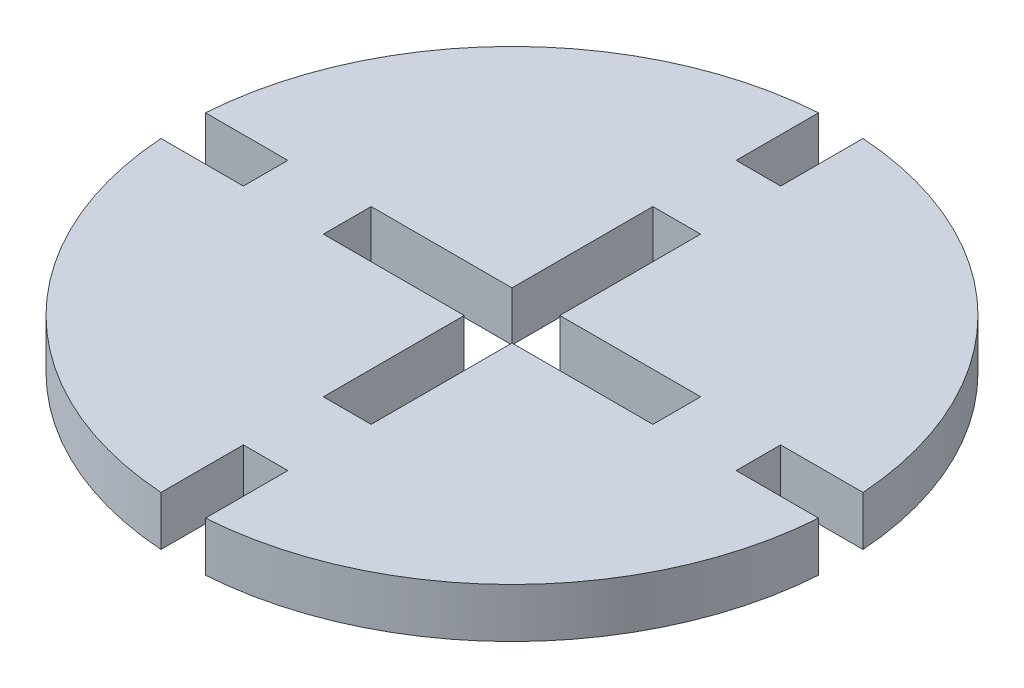
ISO-10303-21;
HEADER;
FILE_DESCRIPTION(('STEP AP214'),'2;1');
FILE_NAME('part.step','',(''),(''),'','','');
FILE_SCHEMA(('AUTOMOTIVE_DESIGN { 1 0 10303 214 1 1 1 1 }'));
ENDSEC;
DATA;
#1=APPLICATION_CONTEXT('core data for automotive mechanical design processes');
#2=APPLICATION_PROTOCOL_DEFINITION('international standard','automotive_design',2000,#1);
#3=PRODUCT_CONTEXT('',#1,'mechanical');
#4=PRODUCT('Part','Part','',(#3));
#5=PRODUCT_RELATED_PRODUCT_CATEGORY('part','',(#4));
#6=PRODUCT_DEFINITION_FORMATION('','',#4);
#7=PRODUCT_DEFINITION_CONTEXT('part definition',#1,'design');
#8=PRODUCT_DEFINITION('design','',#6,#7);
#9=PRODUCT_DEFINITION_SHAPE('','',#8);
#10=(LENGTH_UNIT() NAMED_UNIT(*) SI_UNIT(.MILLI.,.METRE.));
#11=(NAMED_UNIT(*) PLANE_ANGLE_UNIT() SI_UNIT($,.RADIAN.));
#12=(NAMED_UNIT(*) SI_UNIT($,.STERADIAN.) SOLID_ANGLE_UNIT());
#13=UNCERTAINTY_MEASURE_WITH_UNIT(LENGTH_MEASURE(1.E-05),#10,'distance_accuracy_value','');
#14=(GEOMETRIC_REPRESENTATION_CONTEXT(3) GLOBAL_UNCERTAINTY_ASSIGNED_CONTEXT((#13)) GLOBAL_UNIT_ASSIGNED_CONTEXT((#10,
#11,#12)) REPRESENTATION_CONTEXT('',''));
#15=CARTESIAN_POINT('',(0.,0.,0.));
#16=DIRECTION('',(0.,0.,1.));
#17=DIRECTION('',(1.,0.,0.));
#18=AXIS2_PLACEMENT_3D('',#15,#16,#17);
#19=CARTESIAN_POINT('',(-19.9543854828957,3.,1.35));
#20=DIRECTION('',(0.,0.,1.));
#21=DIRECTION('',(1.,0.,0.));
#22=AXIS2_PLACEMENT_3D('',#19,#20,#21);
#23=PLANE('',#22);
#24=DIRECTION('',(-1.,0.,0.));
#25=VECTOR('',#24,1.);
#26=CARTESIAN_POINT('',(-19.9543854828957,0.,1.35));
#27=LINE('',#26,#25);
#28=CARTESIAN_POINT('',(-14.9543854828957,0.,1.35));
#29=VERTEX_POINT('',#28);
#30=CARTESIAN_POINT('',(-19.9543854828957,0.,1.35));
#31=VERTEX_POINT('',#30);
#32=EDGE_CURVE('E231',#29,#31,#27,.T.);
#33=ORIENTED_EDGE('',*,*,#32,.T.);
#34=DIRECTION('',(0.,-1.,0.));
#35=VECTOR('',#34,1.);
#36=CARTESIAN_POINT('',(-19.9543854828957,3.,1.35));
#37=LINE('',#36,#35);
#38=CARTESIAN_POINT('',(-19.9543854828957,3.,1.35));
#39=VERTEX_POINT('',#38);
#40=EDGE_CURVE('E11',#39,#31,#37,.T.);
#41=ORIENTED_EDGE('',*,*,#40,.F.);
#42=DIRECTION('',(-1.,0.,0.));
#43=VECTOR('',#42,1.);
#44=CARTESIAN_POINT('',(-19.9543854828957,3.,1.35));
#45=LINE('',#44,#43);
#46=CARTESIAN_POINT('',(-14.9543854828957,3.,1.35));
#47=VERTEX_POINT('',#46);
#48=EDGE_CURVE('E296',#47,#39,#45,.T.);
#49=ORIENTED_EDGE('',*,*,#48,.F.);
#50=DIRECTION('',(0.,-1.,0.));
#51=VECTOR('',#50,1.);
#52=CARTESIAN_POINT('',(-14.9543854828957,3.,1.35));
#53=LINE('',#52,#51);
#54=EDGE_CURVE('E330',#47,#29,#53,.T.);
#55=ORIENTED_EDGE('',*,*,#54,.T.);
#56=EDGE_LOOP('',(#33,#41,#49,#55));
#57=FACE_BOUND('',#56,.T.);
#58=ADVANCED_FACE('F33',(#57),#23,.F.);
#59=CARTESIAN_POINT('',(0.,3.,0.));
#60=DIRECTION('',(0.,-1.,0.));
#61=DIRECTION('',(0.,0.,-1.));
#62=AXIS2_PLACEMENT_3D('',#59,#60,#61);
#63=CYLINDRICAL_SURFACE('',#62,20.);
#64=CARTESIAN_POINT('',(0.,0.,0.));
#65=DIRECTION('',(0.,1.,0.));
#66=DIRECTION('',(0.,0.,-1.));
#67=AXIS2_PLACEMENT_3D('',#64,#65,#66);
#68=CIRCLE('',#67,20.);
#69=CARTESIAN_POINT('',(-1.35,0.,19.9543854828957));
#70=VERTEX_POINT('',#69);
#71=EDGE_CURVE('E333',#31,#70,#68,.T.);
#72=ORIENTED_EDGE('',*,*,#71,.T.);
#73=DIRECTION('',(0.,-1.,0.));
#74=VECTOR('',#73,1.);
#75=CARTESIAN_POINT('',(-1.35,3.,19.9543854828957));
#76=LINE('',#75,#74);
#77=CARTESIAN_POINT('',(-1.35,3.,19.9543854828957));
#78=VERTEX_POINT('',#77);
#79=EDGE_CURVE('E40',#78,#70,#76,.T.);
#80=ORIENTED_EDGE('',*,*,#79,.F.);
#81=CARTESIAN_POINT('',(0.,3.,0.));
#82=DIRECTION('',(0.,1.,0.));
#83=DIRECTION('',(0.,0.,-1.));
#84=AXIS2_PLACEMENT_3D('',#81,#82,#83);
#85=CIRCLE('',#84,20.);
#86=EDGE_CURVE('E299',#39,#78,#85,.T.);
#87=ORIENTED_EDGE('',*,*,#86,.F.);
#88=ORIENTED_EDGE('',*,*,#40,.T.);
#89=EDGE_LOOP('',(#72,#80,#87,#88));
#90=FACE_BOUND('',#89,.T.);
#91=ADVANCED_FACE('F428',(#90),#63,.T.);
#92=CARTESIAN_POINT('',(-1.35,3.,14.9543854828957));
#93=DIRECTION('',(-1.,0.,0.));
#94=DIRECTION('',(0.,0.,1.));
#95=AXIS2_PLACEMENT_3D('',#92,#93,#94);
#96=PLANE('',#95);
#97=DIRECTION('',(0.,0.,-1.));
#98=VECTOR('',#97,1.);
#99=CARTESIAN_POINT('',(-1.35,0.,14.9543854828957));
#100=LINE('',#99,#98);
#101=CARTESIAN_POINT('',(-1.35,0.,14.9543854828957));
#102=VERTEX_POINT('',#101);
#103=EDGE_CURVE('E335',#70,#102,#100,.T.);
#104=ORIENTED_EDGE('',*,*,#103,.T.);
#105=DIRECTION('',(0.,-1.,0.));
#106=VECTOR('',#105,1.);
#107=CARTESIAN_POINT('',(-1.35,3.,14.9543854828957));
#108=LINE('',#107,#106);
#109=CARTESIAN_POINT('',(-1.35,3.,14.9543854828957));
#110=VERTEX_POINT('',#109);
#111=EDGE_CURVE('E400',#110,#102,#108,.T.);
#112=ORIENTED_EDGE('',*,*,#111,.F.);
#113=DIRECTION('',(0.,0.,-1.));
#114=VECTOR('',#113,1.);
#115=CARTESIAN_POINT('',(-1.35,3.,14.9543854828957));
#116=LINE('',#115,#114);
#117=EDGE_CURVE('E302',#78,#110,#116,.T.);
#118=ORIENTED_EDGE('',*,*,#117,.F.);
#119=ORIENTED_EDGE('',*,*,#79,.T.);
#120=EDGE_LOOP('',(#104,#112,#118,#119));
#121=FACE_BOUND('',#120,.T.);
#122=ADVANCED_FACE('F407',(#121),#96,.F.);
#123=CARTESIAN_POINT('',(1.35000000000001,3.,14.9543854828957));
#124=DIRECTION('',(0.,0.,-1.));
#125=DIRECTION('',(-1.,0.,0.));
#126=AXIS2_PLACEMENT_3D('',#123,#124,#125);
#127=PLANE('',#126);
#128=DIRECTION('',(1.,0.,0.));
#129=VECTOR('',#128,1.);
#130=CARTESIAN_POINT('',(1.35000000000001,0.,14.9543854828957));
#131=LINE('',#130,#129);
#132=CARTESIAN_POINT('',(1.35000000000001,0.,14.9543854828957));
#133=VERTEX_POINT('',#132);
#134=EDGE_CURVE('E337',#102,#133,#131,.T.);
#135=ORIENTED_EDGE('',*,*,#134,.T.);
#136=DIRECTION('',(0.,-1.,0.));
#137=VECTOR('',#136,1.);
#138=CARTESIAN_POINT('',(1.35000000000001,3.,14.9543854828957));
#139=LINE('',#138,#137);
#140=CARTESIAN_POINT('',(1.35000000000001,3.,14.9543854828957));
#141=VERTEX_POINT('',#140);
#142=EDGE_CURVE('E397',#141,#133,#139,.T.);
#143=ORIENTED_EDGE('',*,*,#142,.F.);
#144=DIRECTION('',(1.,0.,0.));
#145=VECTOR('',#144,1.);
#146=CARTESIAN_POINT('',(1.35000000000001,3.,14.9543854828957));
#147=LINE('',#146,#145);
#148=EDGE_CURVE('E304',#110,#141,#147,.T.);
#149=ORIENTED_EDGE('',*,*,#148,.F.);
#150=ORIENTED_EDGE('',*,*,#111,.T.);
#151=EDGE_LOOP('',(#135,#143,#149,#150));
#152=FACE_BOUND('',#151,.T.);
#153=ADVANCED_FACE('F416',(#152),#127,.F.);
#154=CARTESIAN_POINT('',(1.35000000000001,3.,14.9543854828957));
#155=DIRECTION('',(1.,0.,0.));
#156=DIRECTION('',(0.,0.,-1.));
#157=AXIS2_PLACEMENT_3D('',#154,#155,#156);
#158=PLANE('',#157);
#159=DIRECTION('',(0.,0.,1.));
#160=VECTOR('',#159,1.);
#161=CARTESIAN_POINT('',(1.35000000000001,0.,14.9543854828957));
#162=LINE('',#161,#160);
#163=CARTESIAN_POINT('',(1.35000000000001,0.,19.9543854828957));
#164=VERTEX_POINT('',#163);
#165=EDGE_CURVE('E339',#133,#164,#162,.T.);
#166=ORIENTED_EDGE('',*,*,#165,.T.);
#167=DIRECTION('',(0.,-1.,0.));
#168=VECTOR('',#167,1.);
#169=CARTESIAN_POINT('',(1.35000000000001,3.,19.9543854828957));
#170=LINE('',#169,#168);
#171=CARTESIAN_POINT('',(1.35000000000001,3.,19.9543854828957));
#172=VERTEX_POINT('',#171);
#173=EDGE_CURVE('E394',#172,#164,#170,.T.);
#174=ORIENTED_EDGE('',*,*,#173,.F.);
#175=DIRECTION('',(0.,0.,1.));
#176=VECTOR('',#175,1.);
#177=CARTESIAN_POINT('',(1.35000000000001,3.,14.9543854828957));
#178=LINE('',#177,#176);
#179=EDGE_CURVE('E306',#141,#172,#178,.T.);
#180=ORIENTED_EDGE('',*,*,#179,.F.);
#181=ORIENTED_EDGE('',*,*,#142,.T.);
#182=EDGE_LOOP('',(#166,#174,#180,#181));
#183=FACE_BOUND('',#182,.T.);
#184=ADVANCED_FACE('F420',(#183),#158,.F.);
#185=CARTESIAN_POINT('',(0.,3.,0.));
#186=DIRECTION('',(0.,-1.,0.));
#187=DIRECTION('',(0.,0.,-1.));
#188=AXIS2_PLACEMENT_3D('',#185,#186,#187);
#189=CYLINDRICAL_SURFACE('',#188,20.);
#190=CARTESIAN_POINT('',(0.,0.,0.));
#191=DIRECTION('',(0.,1.,0.));
#192=DIRECTION('',(0.,0.,1.));
#193=AXIS2_PLACEMENT_3D('',#190,#191,#192);
#194=CIRCLE('',#193,20.);
#195=CARTESIAN_POINT('',(19.9543854828957,0.,1.34999999999999));
#196=VERTEX_POINT('',#195);
#197=EDGE_CURVE('E341',#164,#196,#194,.T.);
#198=ORIENTED_EDGE('',*,*,#197,.T.);
#199=DIRECTION('',(0.,-1.,0.));
#200=VECTOR('',#199,1.);
#201=CARTESIAN_POINT('',(19.9543854828957,3.,1.34999999999999));
#202=LINE('',#201,#200);
#203=CARTESIAN_POINT('',(19.9543854828957,3.,1.34999999999999));
#204=VERTEX_POINT('',#203);
#205=EDGE_CURVE('E391',#204,#196,#202,.T.);
#206=ORIENTED_EDGE('',*,*,#205,.F.);
#207=CARTESIAN_POINT('',(0.,3.,0.));
#208=DIRECTION('',(0.,1.,0.));
#209=DIRECTION('',(0.,0.,1.));
#210=AXIS2_PLACEMENT_3D('',#207,#208,#209);
#211=CIRCLE('',#210,20.);
#212=EDGE_CURVE('E308',#172,#204,#211,.T.);
#213=ORIENTED_EDGE('',*,*,#212,.F.);
#214=ORIENTED_EDGE('',*,*,#173,.T.);
#215=EDGE_LOOP('',(#198,#206,#213,#214));
#216=FACE_BOUND('',#215,.T.);
#217=ADVANCED_FACE('F481',(#216),#189,.T.);
#218=CARTESIAN_POINT('',(19.9543854828957,3.,1.34999999999999));
#219=DIRECTION('',(0.,0.,1.));
#220=DIRECTION('',(1.,0.,0.));
#221=AXIS2_PLACEMENT_3D('',#218,#219,#220);
#222=PLANE('',#221);
#223=DIRECTION('',(-1.,0.,0.));
#224=VECTOR('',#223,1.);
#225=CARTESIAN_POINT('',(19.9543854828957,0.,1.34999999999999));
#226=LINE('',#225,#224);
#227=CARTESIAN_POINT('',(14.9543854828957,0.,1.35));
#228=VERTEX_POINT('',#227);
#229=EDGE_CURVE('E343',#196,#228,#226,.T.);
#230=ORIENTED_EDGE('',*,*,#229,.T.);
#231=DIRECTION('',(0.,-1.,0.));
#232=VECTOR('',#231,1.);
#233=CARTESIAN_POINT('',(14.9543854828957,3.,1.35));
#234=LINE('',#233,#232);
#235=CARTESIAN_POINT('',(14.9543854828957,3.,1.35));
#236=VERTEX_POINT('',#235);
#237=EDGE_CURVE('E388',#236,#228,#234,.T.);
#238=ORIENTED_EDGE('',*,*,#237,.F.);
#239=DIRECTION('',(-1.,0.,0.));
#240=VECTOR('',#239,1.);
#241=CARTESIAN_POINT('',(19.9543854828957,3.,1.34999999999999));
#242=LINE('',#241,#240);
#243=EDGE_CURVE('E310',#204,#236,#242,.T.);
#244=ORIENTED_EDGE('',*,*,#243,.F.);
#245=ORIENTED_EDGE('',*,*,#205,.T.);
#246=EDGE_LOOP('',(#230,#238,#244,#245));
#247=FACE_BOUND('',#246,.T.);
#248=ADVANCED_FACE('F478',(#247),#222,.F.);
#249=CARTESIAN_POINT('',(14.9543854828957,3.,-1.35));
#250=DIRECTION('',(-1.,0.,0.));
#251=DIRECTION('',(0.,0.,1.));
#252=AXIS2_PLACEMENT_3D('',#249,#250,#251);
#253=PLANE('',#252);
#254=DIRECTION('',(0.,0.,-1.));
#255=VECTOR('',#254,1.);
#256=CARTESIAN_POINT('',(14.9543854828957,0.,-1.35));
#257=LINE('',#256,#255);
#258=CARTESIAN_POINT('',(14.9543854828957,0.,-1.35));
#259=VERTEX_POINT('',#258);
#260=EDGE_CURVE('E345',#228,#259,#257,.T.);
#261=ORIENTED_EDGE('',*,*,#260,.T.);
#262=DIRECTION('',(0.,-1.,0.));
#263=VECTOR('',#262,1.);
#264=CARTESIAN_POINT('',(14.9543854828957,3.,-1.35));
#265=LINE('',#264,#263);
#266=CARTESIAN_POINT('',(14.9543854828957,3.,-1.35));
#267=VERTEX_POINT('',#266);
#268=EDGE_CURVE('E385',#267,#259,#265,.T.);
#269=ORIENTED_EDGE('',*,*,#268,.F.);
#270=DIRECTION('',(0.,0.,-1.));
#271=VECTOR('',#270,1.);
#272=CARTESIAN_POINT('',(14.9543854828957,3.,-1.35));
#273=LINE('',#272,#271);
#274=EDGE_CURVE('E312',#236,#267,#273,.T.);
#275=ORIENTED_EDGE('',*,*,#274,.F.);
#276=ORIENTED_EDGE('',*,*,#237,.T.);
#277=EDGE_LOOP('',(#261,#269,#275,#276));
#278=FACE_BOUND('',#277,.T.);
#279=ADVANCED_FACE('F474',(#278),#253,.F.);
#280=CARTESIAN_POINT('',(19.9543854828957,3.,-1.34999999999999));
#281=DIRECTION('',(0.,0.,-1.));
#282=DIRECTION('',(-1.,0.,0.));
#283=AXIS2_PLACEMENT_3D('',#280,#281,#282);
#284=PLANE('',#283);
#285=DIRECTION('',(1.,0.,0.));
#286=VECTOR('',#285,1.);
#287=CARTESIAN_POINT('',(19.9543854828957,0.,-1.34999999999999));
#288=LINE('',#287,#286);
#289=CARTESIAN_POINT('',(19.9543854828957,0.,-1.34999999999999));
#290=VERTEX_POINT('',#289);
#291=EDGE_CURVE('E347',#259,#290,#288,.T.);
#292=ORIENTED_EDGE('',*,*,#291,.T.);
#293=DIRECTION('',(0.,-1.,0.));
#294=VECTOR('',#293,1.);
#295=CARTESIAN_POINT('',(19.9543854828957,3.,-1.34999999999999));
#296=LINE('',#295,#294);
#297=CARTESIAN_POINT('',(19.9543854828957,3.,-1.34999999999999));
#298=VERTEX_POINT('',#297);
#299=EDGE_CURVE('E382',#298,#290,#296,.T.);
#300=ORIENTED_EDGE('',*,*,#299,.F.);
#301=DIRECTION('',(1.,0.,0.));
#302=VECTOR('',#301,1.);
#303=CARTESIAN_POINT('',(19.9543854828957,3.,-1.34999999999999));
#304=LINE('',#303,#302);
#305=EDGE_CURVE('E314',#267,#298,#304,.T.);
#306=ORIENTED_EDGE('',*,*,#305,.F.);
#307=ORIENTED_EDGE('',*,*,#268,.T.);
#308=EDGE_LOOP('',(#292,#300,#306,#307));
#309=FACE_BOUND('',#308,.T.);
#310=ADVANCED_FACE('F470',(#309),#284,.F.);
#311=CARTESIAN_POINT('',(0.,3.,0.));
#312=DIRECTION('',(0.,-1.,0.));
#313=DIRECTION('',(0.,0.,-1.));
#314=AXIS2_PLACEMENT_3D('',#311,#312,#313);
#315=CYLINDRICAL_SURFACE('',#314,20.);
#316=CARTESIAN_POINT('',(0.,0.,0.));
#317=DIRECTION('',(0.,1.,0.));
#318=DIRECTION('',(0.,0.,-1.));
#319=AXIS2_PLACEMENT_3D('',#316,#317,#318);
#320=CIRCLE('',#319,20.);
#321=CARTESIAN_POINT('',(1.35000000000001,0.,-19.9543854828957));
#322=VERTEX_POINT('',#321);
#323=EDGE_CURVE('E349',#290,#322,#320,.T.);
#324=ORIENTED_EDGE('',*,*,#323,.T.);
#325=DIRECTION('',(0.,-1.,0.));
#326=VECTOR('',#325,1.);
#327=CARTESIAN_POINT('',(1.35000000000001,3.,-19.9543854828957));
#328=LINE('',#327,#326);
#329=CARTESIAN_POINT('',(1.35000000000001,3.,-19.9543854828957));
#330=VERTEX_POINT('',#329);
#331=EDGE_CURVE('E379',#330,#322,#328,.T.);
#332=ORIENTED_EDGE('',*,*,#331,.F.);
#333=CARTESIAN_POINT('',(0.,3.,0.));
#334=DIRECTION('',(0.,1.,0.));
#335=DIRECTION('',(0.,0.,-1.));
#336=AXIS2_PLACEMENT_3D('',#333,#334,#335);
#337=CIRCLE('',#336,20.);
#338=EDGE_CURVE('E316',#298,#330,#337,.T.);
#339=ORIENTED_EDGE('',*,*,#338,.F.);
#340=ORIENTED_EDGE('',*,*,#299,.T.);
#341=EDGE_LOOP('',(#324,#332,#339,#340));
#342=FACE_BOUND('',#341,.T.);
#343=ADVANCED_FACE('F465',(#342),#315,.T.);
#344=CARTESIAN_POINT('',(1.35000000000001,3.,-14.9543854828957));
#345=DIRECTION('',(1.,0.,0.));
#346=DIRECTION('',(0.,0.,-1.));
#347=AXIS2_PLACEMENT_3D('',#344,#345,#346);
#348=PLANE('',#347);
#349=DIRECTION('',(0.,0.,1.));
#350=VECTOR('',#349,1.);
#351=CARTESIAN_POINT('',(1.35000000000001,0.,-14.9543854828957));
#352=LINE('',#351,#350);
#353=CARTESIAN_POINT('',(1.35000000000001,0.,-14.9543854828957));
#354=VERTEX_POINT('',#353);
#355=EDGE_CURVE('E351',#322,#354,#352,.T.);
#356=ORIENTED_EDGE('',*,*,#355,.T.);
#357=DIRECTION('',(0.,-1.,0.));
#358=VECTOR('',#357,1.);
#359=CARTESIAN_POINT('',(1.35000000000001,3.,-14.9543854828957));
#360=LINE('',#359,#358);
#361=CARTESIAN_POINT('',(1.35000000000001,3.,-14.9543854828957));
#362=VERTEX_POINT('',#361);
#363=EDGE_CURVE('E376',#362,#354,#360,.T.);
#364=ORIENTED_EDGE('',*,*,#363,.F.);
#365=DIRECTION('',(0.,0.,1.));
#366=VECTOR('',#365,1.);
#367=CARTESIAN_POINT('',(1.35000000000001,3.,-14.9543854828957));
#368=LINE('',#367,#366);
#369=EDGE_CURVE('E318',#330,#362,#368,.T.);
#370=ORIENTED_EDGE('',*,*,#369,.F.);
#371=ORIENTED_EDGE('',*,*,#331,.T.);
#372=EDGE_LOOP('',(#356,#364,#370,#371));
#373=FACE_BOUND('',#372,.T.);
#374=ADVANCED_FACE('F459',(#373),#348,.F.);
#375=CARTESIAN_POINT('',(1.35000000000001,3.,-14.9543854828957));
#376=DIRECTION('',(0.,0.,1.));
#377=DIRECTION('',(1.,0.,0.));
#378=AXIS2_PLACEMENT_3D('',#375,#376,#377);
#379=PLANE('',#378);
#380=DIRECTION('',(-1.,0.,0.));
#381=VECTOR('',#380,1.);
#382=CARTESIAN_POINT('',(1.35000000000001,0.,-14.9543854828957));
#383=LINE('',#382,#381);
#384=CARTESIAN_POINT('',(-1.35,0.,-14.9543854828957));
#385=VERTEX_POINT('',#384);
#386=EDGE_CURVE('E353',#354,#385,#383,.T.);
#387=ORIENTED_EDGE('',*,*,#386,.T.);
#388=DIRECTION('',(0.,-1.,0.));
#389=VECTOR('',#388,1.);
#390=CARTESIAN_POINT('',(-1.35,3.,-14.9543854828957));
#391=LINE('',#390,#389);
#392=CARTESIAN_POINT('',(-1.35,3.,-14.9543854828957));
#393=VERTEX_POINT('',#392);
#394=EDGE_CURVE('E373',#393,#385,#391,.T.);
#395=ORIENTED_EDGE('',*,*,#394,.F.);
#396=DIRECTION('',(-1.,0.,0.));
#397=VECTOR('',#396,1.);
#398=CARTESIAN_POINT('',(1.35000000000001,3.,-14.9543854828957));
#399=LINE('',#398,#397);
#400=EDGE_CURVE('E320',#362,#393,#399,.T.);
#401=ORIENTED_EDGE('',*,*,#400,.F.);
#402=ORIENTED_EDGE('',*,*,#363,.T.);
#403=EDGE_LOOP('',(#387,#395,#401,#402));
#404=FACE_BOUND('',#403,.T.);
#405=ADVANCED_FACE('F455',(#404),#379,.F.);
#406=CARTESIAN_POINT('',(-1.35,3.,-14.9543854828957));
#407=DIRECTION('',(-1.,0.,0.));
#408=DIRECTION('',(0.,0.,1.));
#409=AXIS2_PLACEMENT_3D('',#406,#407,#408);
#410=PLANE('',#409);
#411=DIRECTION('',(0.,0.,-1.));
#412=VECTOR('',#411,1.);
#413=CARTESIAN_POINT('',(-1.35,0.,-14.9543854828957));
#414=LINE('',#413,#412);
#415=CARTESIAN_POINT('',(-1.34999999999999,0.,-19.9543854828957));
#416=VERTEX_POINT('',#415);
#417=EDGE_CURVE('E355',#385,#416,#414,.T.);
#418=ORIENTED_EDGE('',*,*,#417,.T.);
#419=DIRECTION('',(0.,-1.,0.));
#420=VECTOR('',#419,1.);
#421=CARTESIAN_POINT('',(-1.34999999999999,3.,-19.9543854828957));
#422=LINE('',#421,#420);
#423=CARTESIAN_POINT('',(-1.34999999999999,3.,-19.9543854828957));
#424=VERTEX_POINT('',#423);
#425=EDGE_CURVE('E370',#424,#416,#422,.T.);
#426=ORIENTED_EDGE('',*,*,#425,.F.);
#427=DIRECTION('',(0.,0.,-1.));
#428=VECTOR('',#427,1.);
#429=CARTESIAN_POINT('',(-1.35,3.,-14.9543854828957));
#430=LINE('',#429,#428);
#431=EDGE_CURVE('E322',#393,#424,#430,.T.);
#432=ORIENTED_EDGE('',*,*,#431,.F.);
#433=ORIENTED_EDGE('',*,*,#394,.T.);
#434=EDGE_LOOP('',(#418,#426,#432,#433));
#435=FACE_BOUND('',#434,.T.);
#436=ADVANCED_FACE('F450',(#435),#410,.F.);
#437=CARTESIAN_POINT('',(0.,3.,0.));
#438=DIRECTION('',(0.,-1.,0.));
#439=DIRECTION('',(0.,0.,-1.));
#440=AXIS2_PLACEMENT_3D('',#437,#438,#439);
#441=CYLINDRICAL_SURFACE('',#440,20.);
#442=CARTESIAN_POINT('',(0.,0.,0.));
#443=DIRECTION('',(0.,1.,0.));
#444=DIRECTION('',(0.,0.,1.));
#445=AXIS2_PLACEMENT_3D('',#442,#443,#444);
#446=CIRCLE('',#445,20.);
#447=CARTESIAN_POINT('',(-19.9543854828957,0.,-1.35));
#448=VERTEX_POINT('',#447);
#449=EDGE_CURVE('E357',#416,#448,#446,.T.);
#450=ORIENTED_EDGE('',*,*,#449,.T.);
#451=DIRECTION('',(0.,-1.,0.));
#452=VECTOR('',#451,1.);
#453=CARTESIAN_POINT('',(-19.9543854828957,3.,-1.35));
#454=LINE('',#453,#452);
#455=CARTESIAN_POINT('',(-19.9543854828957,3.,-1.35));
#456=VERTEX_POINT('',#455);
#457=EDGE_CURVE('E367',#456,#448,#454,.T.);
#458=ORIENTED_EDGE('',*,*,#457,.F.);
#459=CARTESIAN_POINT('',(0.,3.,0.));
#460=DIRECTION('',(0.,1.,0.));
#461=DIRECTION('',(0.,0.,1.));
#462=AXIS2_PLACEMENT_3D('',#459,#460,#461);
#463=CIRCLE('',#462,20.);
#464=EDGE_CURVE('E324',#424,#456,#463,.T.);
#465=ORIENTED_EDGE('',*,*,#464,.F.);
#466=ORIENTED_EDGE('',*,*,#425,.T.);
#467=EDGE_LOOP('',(#450,#458,#465,#466));
#468=FACE_BOUND('',#467,.T.);
#469=ADVANCED_FACE('F444',(#468),#441,.T.);
#470=CARTESIAN_POINT('',(-19.9543854828957,3.,-1.35));
#471=DIRECTION('',(0.,0.,-1.));
#472=DIRECTION('',(-1.,0.,0.));
#473=AXIS2_PLACEMENT_3D('',#470,#471,#472);
#474=PLANE('',#473);
#475=DIRECTION('',(1.,0.,0.));
#476=VECTOR('',#475,1.);
#477=CARTESIAN_POINT('',(-19.9543854828957,0.,-1.35));
#478=LINE('',#477,#476);
#479=CARTESIAN_POINT('',(-14.9543854828957,0.,-1.35));
#480=VERTEX_POINT('',#479);
#481=EDGE_CURVE('E359',#448,#480,#478,.T.);
#482=ORIENTED_EDGE('',*,*,#481,.T.);
#483=DIRECTION('',(0.,-1.,0.));
#484=VECTOR('',#483,1.);
#485=CARTESIAN_POINT('',(-14.9543854828957,3.,-1.35));
#486=LINE('',#485,#484);
#487=CARTESIAN_POINT('',(-14.9543854828957,3.,-1.35));
#488=VERTEX_POINT('',#487);
#489=EDGE_CURVE('E364',#488,#480,#486,.T.);
#490=ORIENTED_EDGE('',*,*,#489,.F.);
#491=DIRECTION('',(1.,0.,0.));
#492=VECTOR('',#491,1.);
#493=CARTESIAN_POINT('',(-19.9543854828957,3.,-1.35));
#494=LINE('',#493,#492);
#495=EDGE_CURVE('E326',#456,#488,#494,.T.);
#496=ORIENTED_EDGE('',*,*,#495,.F.);
#497=ORIENTED_EDGE('',*,*,#457,.T.);
#498=EDGE_LOOP('',(#482,#490,#496,#497));
#499=FACE_BOUND('',#498,.T.);
#500=ADVANCED_FACE('F440',(#499),#474,.F.);
#501=CARTESIAN_POINT('',(-14.9543854828957,3.,-1.35));
#502=DIRECTION('',(1.,0.,0.));
#503=DIRECTION('',(0.,0.,-1.));
#504=AXIS2_PLACEMENT_3D('',#501,#502,#503);
#505=PLANE('',#504);
#506=DIRECTION('',(0.,0.,1.));
#507=VECTOR('',#506,1.);
#508=CARTESIAN_POINT('',(-14.9543854828957,0.,-1.35));
#509=LINE('',#508,#507);
#510=EDGE_CURVE('E300',#480,#29,#509,.T.);
#511=ORIENTED_EDGE('',*,*,#510,.T.);
#512=ORIENTED_EDGE('',*,*,#54,.F.);
#513=DIRECTION('',(0.,0.,1.));
#514=VECTOR('',#513,1.);
#515=CARTESIAN_POINT('',(-14.9543854828957,3.,-1.35));
#516=LINE('',#515,#514);
#517=EDGE_CURVE('E328',#488,#47,#516,.T.);
#518=ORIENTED_EDGE('',*,*,#517,.F.);
#519=ORIENTED_EDGE('',*,*,#489,.T.);
#520=EDGE_LOOP('',(#511,#512,#518,#519));
#521=FACE_BOUND('',#520,.T.);
#522=ADVANCED_FACE('F435',(#521),#505,.F.);
#523=CARTESIAN_POINT('',(0.,3.,0.));
#524=DIRECTION('',(0.,1.,0.));
#525=DIRECTION('',(0.,0.,1.));
#526=AXIS2_PLACEMENT_3D('',#523,#524,#525);
#527=PLANE('',#526);
#528=DIRECTION('',(0.,0.,-1.));
#529=VECTOR('',#528,1.);
#530=CARTESIAN_POINT('',(10.,3.,1.45));
#531=LINE('',#530,#529);
#532=CARTESIAN_POINT('',(10.,3.,1.45));
#533=VERTEX_POINT('',#532);
#534=CARTESIAN_POINT('',(10.,3.,-1.45));
#535=VERTEX_POINT('',#534);
#536=EDGE_CURVE('E47',#533,#535,#531,.T.);
#537=ORIENTED_EDGE('',*,*,#536,.F.);
#538=DIRECTION('',(1.,0.,0.));
#539=VECTOR('',#538,1.);
#540=CARTESIAN_POINT('',(1.45,3.,1.45));
#541=LINE('',#540,#539);
#542=CARTESIAN_POINT('',(1.45,3.,1.45));
#543=VERTEX_POINT('',#542);
#544=EDGE_CURVE('E225',#543,#533,#541,.T.);
#545=ORIENTED_EDGE('',*,*,#544,.F.);
#546=DIRECTION('',(0.,0.,-1.));
#547=VECTOR('',#546,1.);
#548=CARTESIAN_POINT('',(1.45,3.,10.));
#549=LINE('',#548,#547);
#550=CARTESIAN_POINT('',(1.45,3.,10.));
#551=VERTEX_POINT('',#550);
#552=EDGE_CURVE('E271',#551,#543,#549,.T.);
#553=ORIENTED_EDGE('',*,*,#552,.F.);
#554=DIRECTION('',(1.,0.,0.));
#555=VECTOR('',#554,1.);
#556=CARTESIAN_POINT('',(-1.45,3.,10.));
#557=LINE('',#556,#555);
#558=CARTESIAN_POINT('',(-1.45,3.,10.));
#559=VERTEX_POINT('',#558);
#560=EDGE_CURVE('E268',#559,#551,#557,.T.);
#561=ORIENTED_EDGE('',*,*,#560,.F.);
#562=DIRECTION('',(0.,0.,1.));
#563=VECTOR('',#562,1.);
#564=CARTESIAN_POINT('',(-1.45,3.,10.));
#565=LINE('',#564,#563);
#566=CARTESIAN_POINT('',(-1.45,3.,1.45));
#567=VERTEX_POINT('',#566);
#568=EDGE_CURVE('E265',#567,#559,#565,.T.);
#569=ORIENTED_EDGE('',*,*,#568,.F.);
#570=DIRECTION('',(1.,0.,0.));
#571=VECTOR('',#570,1.);
#572=CARTESIAN_POINT('',(-10.,3.,1.45));
#573=LINE('',#572,#571);
#574=CARTESIAN_POINT('',(-10.,3.,1.45));
#575=VERTEX_POINT('',#574);
#576=EDGE_CURVE('E262',#575,#567,#573,.T.);
#577=ORIENTED_EDGE('',*,*,#576,.F.);
#578=DIRECTION('',(0.,0.,1.));
#579=VECTOR('',#578,1.);
#580=CARTESIAN_POINT('',(-10.,3.,1.45));
#581=LINE('',#580,#579);
#582=CARTESIAN_POINT('',(-10.,3.,-1.45));
#583=VERTEX_POINT('',#582);
#584=EDGE_CURVE('E259',#583,#575,#581,.T.);
#585=ORIENTED_EDGE('',*,*,#584,.F.);
#586=DIRECTION('',(-1.,0.,0.));
#587=VECTOR('',#586,1.);
#588=CARTESIAN_POINT('',(-10.,3.,-1.45));
#589=LINE('',#588,#587);
#590=CARTESIAN_POINT('',(-1.45,3.,-1.45));
#591=VERTEX_POINT('',#590);
#592=EDGE_CURVE('E256',#591,#583,#589,.T.);
#593=ORIENTED_EDGE('',*,*,#592,.F.);
#594=DIRECTION('',(0.,0.,1.));
#595=VECTOR('',#594,1.);
#596=CARTESIAN_POINT('',(-1.45,3.,-1.45));
#597=LINE('',#596,#595);
#598=CARTESIAN_POINT('',(-1.45,3.,-10.));
#599=VERTEX_POINT('',#598);
#600=EDGE_CURVE('E253',#599,#591,#597,.T.);
#601=ORIENTED_EDGE('',*,*,#600,.F.);
#602=DIRECTION('',(-1.,0.,0.));
#603=VECTOR('',#602,1.);
#604=CARTESIAN_POINT('',(-1.45,3.,-10.));
#605=LINE('',#604,#603);
#606=CARTESIAN_POINT('',(1.45,3.,-10.));
#607=VERTEX_POINT('',#606);
#608=EDGE_CURVE('E250',#607,#599,#605,.T.);
#609=ORIENTED_EDGE('',*,*,#608,.F.);
#610=DIRECTION('',(0.,0.,-1.));
#611=VECTOR('',#610,1.);
#612=CARTESIAN_POINT('',(1.45,3.,-1.45));
#613=LINE('',#612,#611);
#614=CARTESIAN_POINT('',(1.45,3.,-1.45));
#615=VERTEX_POINT('',#614);
#616=EDGE_CURVE('E247',#615,#607,#613,.T.);
#617=ORIENTED_EDGE('',*,*,#616,.F.);
#618=DIRECTION('',(-1.,0.,0.));
#619=VECTOR('',#618,1.);
#620=CARTESIAN_POINT('',(1.45,3.,-1.45));
#621=LINE('',#620,#619);
#622=EDGE_CURVE('E240',#535,#615,#621,.T.);
#623=ORIENTED_EDGE('',*,*,#622,.F.);
#624=EDGE_LOOP('',(#537,#545,#553,#561,#569,#577,#585,#593,#601,#609,#617,#623));
#625=FACE_BOUND('',#624,.T.);
#626=ORIENTED_EDGE('',*,*,#48,.T.);
#627=ORIENTED_EDGE('',*,*,#86,.T.);
#628=ORIENTED_EDGE('',*,*,#117,.T.);
#629=ORIENTED_EDGE('',*,*,#148,.T.);
#630=ORIENTED_EDGE('',*,*,#179,.T.);
#631=ORIENTED_EDGE('',*,*,#212,.T.);
#632=ORIENTED_EDGE('',*,*,#243,.T.);
#633=ORIENTED_EDGE('',*,*,#274,.T.);
#634=ORIENTED_EDGE('',*,*,#305,.T.);
#635=ORIENTED_EDGE('',*,*,#338,.T.);
#636=ORIENTED_EDGE('',*,*,#369,.T.);
#637=ORIENTED_EDGE('',*,*,#400,.T.);
#638=ORIENTED_EDGE('',*,*,#431,.T.);
#639=ORIENTED_EDGE('',*,*,#464,.T.);
#640=ORIENTED_EDGE('',*,*,#495,.T.);
#641=ORIENTED_EDGE('',*,*,#517,.T.);
#642=EDGE_LOOP('',(#626,#627,#628,#629,#630,#631,#632,#633,#634,#635,#636,#637,#638,#639,#640,#641));
#643=FACE_BOUND('',#642,.T.);
#644=ADVANCED_FACE('F424',(#625,#643),#527,.T.);
#645=CARTESIAN_POINT('',(0.,0.,0.));
#646=DIRECTION('',(0.,1.,0.));
#647=DIRECTION('',(0.,0.,1.));
#648=AXIS2_PLACEMENT_3D('',#645,#646,#647);
#649=PLANE('',#648);
#650=DIRECTION('',(-1.,0.,0.));
#651=VECTOR('',#650,1.);
#652=CARTESIAN_POINT('',(1.45,0.,1.45));
#653=LINE('',#652,#651);
#654=CARTESIAN_POINT('',(10.,0.,1.45));
#655=VERTEX_POINT('',#654);
#656=CARTESIAN_POINT('',(1.45,0.,1.45));
#657=VERTEX_POINT('',#656);
#658=EDGE_CURVE('E238',#655,#657,#653,.T.);
#659=ORIENTED_EDGE('',*,*,#658,.F.);
#660=DIRECTION('',(0.,0.,1.));
#661=VECTOR('',#660,1.);
#662=CARTESIAN_POINT('',(10.,0.,1.45));
#663=LINE('',#662,#661);
#664=CARTESIAN_POINT('',(10.,0.,-1.45));
#665=VERTEX_POINT('',#664);
#666=EDGE_CURVE('E219',#665,#655,#663,.T.);
#667=ORIENTED_EDGE('',*,*,#666,.F.);
#668=DIRECTION('',(1.,0.,0.));
#669=VECTOR('',#668,1.);
#670=CARTESIAN_POINT('',(1.45,0.,-1.45));
#671=LINE('',#670,#669);
#672=CARTESIAN_POINT('',(1.45,0.,-1.45));
#673=VERTEX_POINT('',#672);
#674=EDGE_CURVE('E228',#673,#665,#671,.T.);
#675=ORIENTED_EDGE('',*,*,#674,.F.);
#676=DIRECTION('',(0.,0.,1.));
#677=VECTOR('',#676,1.);
#678=CARTESIAN_POINT('',(1.45,0.,-1.45));
#679=LINE('',#678,#677);
#680=CARTESIAN_POINT('',(1.45,0.,-10.));
#681=VERTEX_POINT('',#680);
#682=EDGE_CURVE('E55',#681,#673,#679,.T.);
#683=ORIENTED_EDGE('',*,*,#682,.F.);
#684=DIRECTION('',(1.,0.,0.));
#685=VECTOR('',#684,1.);
#686=CARTESIAN_POINT('',(-1.45,0.,-10.));
#687=LINE('',#686,#685);
#688=CARTESIAN_POINT('',(-1.45,0.,-10.));
#689=VERTEX_POINT('',#688);
#690=EDGE_CURVE('E728',#689,#681,#687,.T.);
#691=ORIENTED_EDGE('',*,*,#690,.F.);
#692=DIRECTION('',(0.,0.,-1.));
#693=VECTOR('',#692,1.);
#694=CARTESIAN_POINT('',(-1.45,0.,-1.45));
#695=LINE('',#694,#693);
#696=CARTESIAN_POINT('',(-1.45,0.,-1.45));
#697=VERTEX_POINT('',#696);
#698=EDGE_CURVE('E731',#697,#689,#695,.T.);
#699=ORIENTED_EDGE('',*,*,#698,.F.);
#700=DIRECTION('',(1.,0.,0.));
#701=VECTOR('',#700,1.);
#702=CARTESIAN_POINT('',(-10.,0.,-1.45));
#703=LINE('',#702,#701);
#704=CARTESIAN_POINT('',(-10.,0.,-1.45));
#705=VERTEX_POINT('',#704);
#706=EDGE_CURVE('E736',#705,#697,#703,.T.);
#707=ORIENTED_EDGE('',*,*,#706,.F.);
#708=DIRECTION('',(0.,0.,-1.));
#709=VECTOR('',#708,1.);
#710=CARTESIAN_POINT('',(-10.,0.,1.45));
#711=LINE('',#710,#709);
#712=CARTESIAN_POINT('',(-10.,0.,1.45));
#713=VERTEX_POINT('',#712);
#714=EDGE_CURVE('E739',#713,#705,#711,.T.);
#715=ORIENTED_EDGE('',*,*,#714,.F.);
#716=DIRECTION('',(-1.,0.,0.));
#717=VECTOR('',#716,1.);
#718=CARTESIAN_POINT('',(-10.,0.,1.45));
#719=LINE('',#718,#717);
#720=CARTESIAN_POINT('',(-1.45,0.,1.45));
#721=VERTEX_POINT('',#720);
#722=EDGE_CURVE('E742',#721,#713,#719,.T.);
#723=ORIENTED_EDGE('',*,*,#722,.F.);
#724=DIRECTION('',(0.,0.,-1.));
#725=VECTOR('',#724,1.);
#726=CARTESIAN_POINT('',(-1.45,0.,10.));
#727=LINE('',#726,#725);
#728=CARTESIAN_POINT('',(-1.45,0.,10.));
#729=VERTEX_POINT('',#728);
#730=EDGE_CURVE('E745',#729,#721,#727,.T.);
#731=ORIENTED_EDGE('',*,*,#730,.F.);
#732=DIRECTION('',(-1.,0.,0.));
#733=VECTOR('',#732,1.);
#734=CARTESIAN_POINT('',(-1.45,0.,10.));
#735=LINE('',#734,#733);
#736=CARTESIAN_POINT('',(1.45,0.,10.));
#737=VERTEX_POINT('',#736);
#738=EDGE_CURVE('E748',#737,#729,#735,.T.);
#739=ORIENTED_EDGE('',*,*,#738,.F.);
#740=DIRECTION('',(0.,0.,1.));
#741=VECTOR('',#740,1.);
#742=CARTESIAN_POINT('',(1.45,0.,10.));
#743=LINE('',#742,#741);
#744=EDGE_CURVE('E242',#657,#737,#743,.T.);
#745=ORIENTED_EDGE('',*,*,#744,.F.);
#746=EDGE_LOOP('',(#659,#667,#675,#683,#691,#699,#707,#715,#723,#731,#739,#745));
#747=FACE_BOUND('',#746,.T.);
#748=ORIENTED_EDGE('',*,*,#32,.F.);
#749=ORIENTED_EDGE('',*,*,#510,.F.);
#750=ORIENTED_EDGE('',*,*,#481,.F.);
#751=ORIENTED_EDGE('',*,*,#449,.F.);
#752=ORIENTED_EDGE('',*,*,#417,.F.);
#753=ORIENTED_EDGE('',*,*,#386,.F.);
#754=ORIENTED_EDGE('',*,*,#355,.F.);
#755=ORIENTED_EDGE('',*,*,#323,.F.);
#756=ORIENTED_EDGE('',*,*,#291,.F.);
#757=ORIENTED_EDGE('',*,*,#260,.F.);
#758=ORIENTED_EDGE('',*,*,#229,.F.);
#759=ORIENTED_EDGE('',*,*,#197,.F.);
#760=ORIENTED_EDGE('',*,*,#165,.F.);
#761=ORIENTED_EDGE('',*,*,#134,.F.);
#762=ORIENTED_EDGE('',*,*,#103,.F.);
#763=ORIENTED_EDGE('',*,*,#71,.F.);
#764=EDGE_LOOP('',(#748,#749,#750,#751,#752,#753,#754,#755,#756,#757,#758,#759,#760,#761,#762,#763));
#765=FACE_BOUND('',#764,.T.);
#766=ADVANCED_FACE('F234',(#747,#765),#649,.F.);
#767=CARTESIAN_POINT('',(10.,-0.00100000000000013,1.45));
#768=DIRECTION('',(1.,0.,0.));
#769=DIRECTION('',(0.,0.,-1.));
#770=AXIS2_PLACEMENT_3D('',#767,#768,#769);
#771=PLANE('',#770);
#772=ORIENTED_EDGE('',*,*,#666,.T.);
#773=DIRECTION('',(0.,1.,0.));
#774=VECTOR('',#773,1.);
#775=CARTESIAN_POINT('',(10.,-0.00100000000000013,1.45));
#776=LINE('',#775,#774);
#777=EDGE_CURVE('E232',#655,#533,#776,.T.);
#778=ORIENTED_EDGE('',*,*,#777,.T.);
#779=ORIENTED_EDGE('',*,*,#536,.T.);
#780=DIRECTION('',(0.,1.,0.));
#781=VECTOR('',#780,1.);
#782=CARTESIAN_POINT('',(10.,-0.00100000000000013,-1.45));
#783=LINE('',#782,#781);
#784=EDGE_CURVE('E215',#665,#535,#783,.T.);
#785=ORIENTED_EDGE('',*,*,#784,.F.);
#786=EDGE_LOOP('',(#772,#778,#779,#785));
#787=FACE_BOUND('',#786,.T.);
#788=ADVANCED_FACE('F217',(#787),#771,.F.);
#789=CARTESIAN_POINT('',(1.45,-0.00100000000000013,1.45));
#790=DIRECTION('',(0.,0.,1.));
#791=DIRECTION('',(1.,0.,0.));
#792=AXIS2_PLACEMENT_3D('',#789,#790,#791);
#793=PLANE('',#792);
#794=ORIENTED_EDGE('',*,*,#658,.T.);
#795=DIRECTION('',(0.,1.,0.));
#796=VECTOR('',#795,1.);
#797=CARTESIAN_POINT('',(1.45,-0.00100000000000013,1.45));
#798=LINE('',#797,#796);
#799=EDGE_CURVE('E277',#657,#543,#798,.T.);
#800=ORIENTED_EDGE('',*,*,#799,.T.);
#801=ORIENTED_EDGE('',*,*,#544,.T.);
#802=ORIENTED_EDGE('',*,*,#777,.F.);
#803=EDGE_LOOP('',(#794,#800,#801,#802));
#804=FACE_BOUND('',#803,.T.);
#805=ADVANCED_FACE('F616',(#804),#793,.F.);
#806=CARTESIAN_POINT('',(1.45,-0.00100000000000013,10.));
#807=DIRECTION('',(1.,0.,0.));
#808=DIRECTION('',(0.,0.,-1.));
#809=AXIS2_PLACEMENT_3D('',#806,#807,#808);
#810=PLANE('',#809);
#811=ORIENTED_EDGE('',*,*,#744,.T.);
#812=DIRECTION('',(0.,1.,0.));
#813=VECTOR('',#812,1.);
#814=CARTESIAN_POINT('',(1.45,-0.00100000000000013,10.));
#815=LINE('',#814,#813);
#816=EDGE_CURVE('E279',#737,#551,#815,.T.);
#817=ORIENTED_EDGE('',*,*,#816,.T.);
#818=ORIENTED_EDGE('',*,*,#552,.T.);
#819=ORIENTED_EDGE('',*,*,#799,.F.);
#820=EDGE_LOOP('',(#811,#817,#818,#819));
#821=FACE_BOUND('',#820,.T.);
#822=ADVANCED_FACE('F625',(#821),#810,.F.);
#823=CARTESIAN_POINT('',(-1.45,-0.00100000000000013,10.));
#824=DIRECTION('',(0.,0.,1.));
#825=DIRECTION('',(1.,0.,0.));
#826=AXIS2_PLACEMENT_3D('',#823,#824,#825);
#827=PLANE('',#826);
#828=ORIENTED_EDGE('',*,*,#738,.T.);
#829=DIRECTION('',(0.,1.,0.));
#830=VECTOR('',#829,1.);
#831=CARTESIAN_POINT('',(-1.45,-0.00100000000000013,10.));
#832=LINE('',#831,#830);
#833=EDGE_CURVE('E281',#729,#559,#832,.T.);
#834=ORIENTED_EDGE('',*,*,#833,.T.);
#835=ORIENTED_EDGE('',*,*,#560,.T.);
#836=ORIENTED_EDGE('',*,*,#816,.F.);
#837=EDGE_LOOP('',(#828,#834,#835,#836));
#838=FACE_BOUND('',#837,.T.);
#839=ADVANCED_FACE('F635',(#838),#827,.F.);
#840=CARTESIAN_POINT('',(-1.45,-0.00100000000000013,10.));
#841=DIRECTION('',(-1.,0.,0.));
#842=DIRECTION('',(0.,0.,1.));
#843=AXIS2_PLACEMENT_3D('',#840,#841,#842);
#844=PLANE('',#843);
#845=ORIENTED_EDGE('',*,*,#730,.T.);
#846=DIRECTION('',(0.,1.,0.));
#847=VECTOR('',#846,1.);
#848=CARTESIAN_POINT('',(-1.45,-0.00100000000000013,1.45));
#849=LINE('',#848,#847);
#850=EDGE_CURVE('E283',#721,#567,#849,.T.);
#851=ORIENTED_EDGE('',*,*,#850,.T.);
#852=ORIENTED_EDGE('',*,*,#568,.T.);
#853=ORIENTED_EDGE('',*,*,#833,.F.);
#854=EDGE_LOOP('',(#845,#851,#852,#853));
#855=FACE_BOUND('',#854,.T.);
#856=ADVANCED_FACE('F645',(#855),#844,.F.);
#857=CARTESIAN_POINT('',(-10.,-0.00100000000000013,1.45));
#858=DIRECTION('',(0.,0.,1.));
#859=DIRECTION('',(1.,0.,0.));
#860=AXIS2_PLACEMENT_3D('',#857,#858,#859);
#861=PLANE('',#860);
#862=ORIENTED_EDGE('',*,*,#722,.T.);
#863=DIRECTION('',(0.,1.,0.));
#864=VECTOR('',#863,1.);
#865=CARTESIAN_POINT('',(-10.,-0.00100000000000013,1.45));
#866=LINE('',#865,#864);
#867=EDGE_CURVE('E285',#713,#575,#866,.T.);
#868=ORIENTED_EDGE('',*,*,#867,.T.);
#869=ORIENTED_EDGE('',*,*,#576,.T.);
#870=ORIENTED_EDGE('',*,*,#850,.F.);
#871=EDGE_LOOP('',(#862,#868,#869,#870));
#872=FACE_BOUND('',#871,.T.);
#873=ADVANCED_FACE('F655',(#872),#861,.F.);
#874=CARTESIAN_POINT('',(-10.,-0.00100000000000013,1.45));
#875=DIRECTION('',(-1.,0.,0.));
#876=DIRECTION('',(0.,0.,1.));
#877=AXIS2_PLACEMENT_3D('',#874,#875,#876);
#878=PLANE('',#877);
#879=ORIENTED_EDGE('',*,*,#714,.T.);
#880=DIRECTION('',(0.,1.,0.));
#881=VECTOR('',#880,1.);
#882=CARTESIAN_POINT('',(-10.,-0.00100000000000013,-1.45));
#883=LINE('',#882,#881);
#884=EDGE_CURVE('E287',#705,#583,#883,.T.);
#885=ORIENTED_EDGE('',*,*,#884,.T.);
#886=ORIENTED_EDGE('',*,*,#584,.T.);
#887=ORIENTED_EDGE('',*,*,#867,.F.);
#888=EDGE_LOOP('',(#879,#885,#886,#887));
#889=FACE_BOUND('',#888,.T.);
#890=ADVANCED_FACE('F665',(#889),#878,.F.);
#891=CARTESIAN_POINT('',(-10.,-0.00100000000000013,-1.45));
#892=DIRECTION('',(0.,0.,-1.));
#893=DIRECTION('',(-1.,0.,0.));
#894=AXIS2_PLACEMENT_3D('',#891,#892,#893);
#895=PLANE('',#894);
#896=ORIENTED_EDGE('',*,*,#706,.T.);
#897=DIRECTION('',(0.,1.,0.));
#898=VECTOR('',#897,1.);
#899=CARTESIAN_POINT('',(-1.45,-0.00100000000000013,-1.45));
#900=LINE('',#899,#898);
#901=EDGE_CURVE('E289',#697,#591,#900,.T.);
#902=ORIENTED_EDGE('',*,*,#901,.T.);
#903=ORIENTED_EDGE('',*,*,#592,.T.);
#904=ORIENTED_EDGE('',*,*,#884,.F.);
#905=EDGE_LOOP('',(#896,#902,#903,#904));
#906=FACE_BOUND('',#905,.T.);
#907=ADVANCED_FACE('F675',(#906),#895,.F.);
#908=CARTESIAN_POINT('',(-1.45,-0.00100000000000013,-1.45));
#909=DIRECTION('',(-1.,0.,0.));
#910=DIRECTION('',(0.,0.,1.));
#911=AXIS2_PLACEMENT_3D('',#908,#909,#910);
#912=PLANE('',#911);
#913=ORIENTED_EDGE('',*,*,#698,.T.);
#914=DIRECTION('',(0.,1.,0.));
#915=VECTOR('',#914,1.);
#916=CARTESIAN_POINT('',(-1.45,-0.00100000000000013,-10.));
#917=LINE('',#916,#915);
#918=EDGE_CURVE('E291',#689,#599,#917,.T.);
#919=ORIENTED_EDGE('',*,*,#918,.T.);
#920=ORIENTED_EDGE('',*,*,#600,.T.);
#921=ORIENTED_EDGE('',*,*,#901,.F.);
#922=EDGE_LOOP('',(#913,#919,#920,#921));
#923=FACE_BOUND('',#922,.T.);
#924=ADVANCED_FACE('F685',(#923),#912,.F.);
#925=CARTESIAN_POINT('',(-1.45,-0.00100000000000013,-10.));
#926=DIRECTION('',(0.,0.,-1.));
#927=DIRECTION('',(-1.,0.,0.));
#928=AXIS2_PLACEMENT_3D('',#925,#926,#927);
#929=PLANE('',#928);
#930=ORIENTED_EDGE('',*,*,#690,.T.);
#931=DIRECTION('',(0.,1.,0.));
#932=VECTOR('',#931,1.);
#933=CARTESIAN_POINT('',(1.45,-0.00100000000000013,-10.));
#934=LINE('',#933,#932);
#935=EDGE_CURVE('E293',#681,#607,#934,.T.);
#936=ORIENTED_EDGE('',*,*,#935,.T.);
#937=ORIENTED_EDGE('',*,*,#608,.T.);
#938=ORIENTED_EDGE('',*,*,#918,.F.);
#939=EDGE_LOOP('',(#930,#936,#937,#938));
#940=FACE_BOUND('',#939,.T.);
#941=ADVANCED_FACE('F695',(#940),#929,.F.);
#942=CARTESIAN_POINT('',(1.45,-0.00100000000000013,-1.45));
#943=DIRECTION('',(1.,0.,0.));
#944=DIRECTION('',(0.,0.,-1.));
#945=AXIS2_PLACEMENT_3D('',#942,#943,#944);
#946=PLANE('',#945);
#947=ORIENTED_EDGE('',*,*,#682,.T.);
#948=DIRECTION('',(0.,1.,0.));
#949=VECTOR('',#948,1.);
#950=CARTESIAN_POINT('',(1.45,-0.00100000000000013,-1.45));
#951=LINE('',#950,#949);
#952=EDGE_CURVE('E224',#673,#615,#951,.T.);
#953=ORIENTED_EDGE('',*,*,#952,.T.);
#954=ORIENTED_EDGE('',*,*,#616,.T.);
#955=ORIENTED_EDGE('',*,*,#935,.F.);
#956=EDGE_LOOP('',(#947,#953,#954,#955));
#957=FACE_BOUND('',#956,.T.);
#958=ADVANCED_FACE('F705',(#957),#946,.F.);
#959=CARTESIAN_POINT('',(1.45,-0.00100000000000013,-1.45));
#960=DIRECTION('',(0.,0.,-1.));
#961=DIRECTION('',(-1.,0.,0.));
#962=AXIS2_PLACEMENT_3D('',#959,#960,#961);
#963=PLANE('',#962);
#964=ORIENTED_EDGE('',*,*,#674,.T.);
#965=ORIENTED_EDGE('',*,*,#784,.T.);
#966=ORIENTED_EDGE('',*,*,#622,.T.);
#967=ORIENTED_EDGE('',*,*,#952,.F.);
#968=EDGE_LOOP('',(#964,#965,#966,#967));
#969=FACE_BOUND('',#968,.T.);
#970=ADVANCED_FACE('F229',(#969),#963,.F.);
#971=CLOSED_SHELL('',(#58,#91,#122,#153,#184,#217,#248,#279,#310,#343,#374,#405,#436,#469,#500,
#522,#644,#766,#788,#805,#822,#839,#856,#873,#890,#907,#924,#941,#958,#970));
#972=MANIFOLD_SOLID_BREP('B2',#971);
#973=ADVANCED_BREP_SHAPE_REPRESENTATION('',(#18,#972),#14);
#974=SHAPE_DEFINITION_REPRESENTATION(#9,#973);
ENDSEC;
END-ISO-10303-21;
